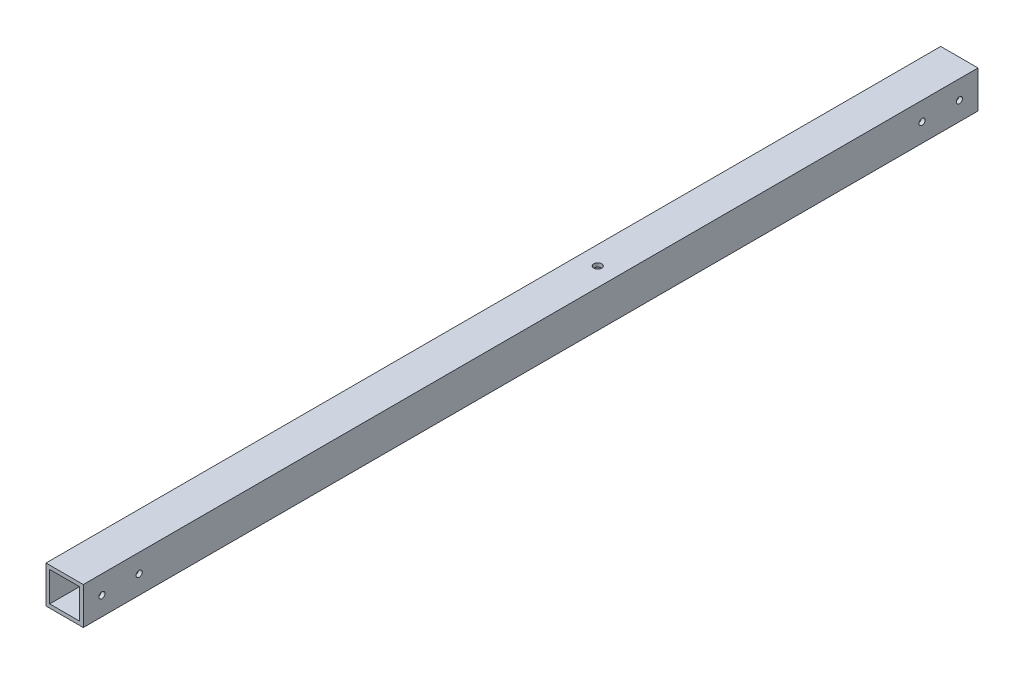
ISO-10303-21;
HEADER;
FILE_DESCRIPTION(('STEP AP214'),'2;1');
FILE_NAME('part.step','',(''),(''),'','','');
FILE_SCHEMA(('AUTOMOTIVE_DESIGN { 1 0 10303 214 1 1 1 1 }'));
ENDSEC;
DATA;
#1=APPLICATION_CONTEXT('core data for automotive mechanical design processes');
#2=APPLICATION_PROTOCOL_DEFINITION('international standard','automotive_design',2000,#1);
#3=PRODUCT_CONTEXT('',#1,'mechanical');
#4=PRODUCT('Part','Part','',(#3));
#5=PRODUCT_RELATED_PRODUCT_CATEGORY('part','',(#4));
#6=PRODUCT_DEFINITION_FORMATION('','',#4);
#7=PRODUCT_DEFINITION_CONTEXT('part definition',#1,'design');
#8=PRODUCT_DEFINITION('design','',#6,#7);
#9=PRODUCT_DEFINITION_SHAPE('','',#8);
#10=(LENGTH_UNIT() NAMED_UNIT(*) SI_UNIT(.MILLI.,.METRE.));
#11=(NAMED_UNIT(*) PLANE_ANGLE_UNIT() SI_UNIT($,.RADIAN.));
#12=(NAMED_UNIT(*) SI_UNIT($,.STERADIAN.) SOLID_ANGLE_UNIT());
#13=UNCERTAINTY_MEASURE_WITH_UNIT(LENGTH_MEASURE(1.E-05),#10,'distance_accuracy_value','');
#14=(GEOMETRIC_REPRESENTATION_CONTEXT(3) GLOBAL_UNCERTAINTY_ASSIGNED_CONTEXT((#13)) GLOBAL_UNIT_ASSIGNED_CONTEXT((#10,
#11,#12)) REPRESENTATION_CONTEXT('',''));
#15=CARTESIAN_POINT('',(0.,0.,0.));
#16=DIRECTION('',(0.,0.,1.));
#17=DIRECTION('',(1.,0.,0.));
#18=AXIS2_PLACEMENT_3D('',#15,#16,#17);
#19=CARTESIAN_POINT('',(10.,10.,560.));
#20=DIRECTION('',(-1.,0.,0.));
#21=DIRECTION('',(0.,0.,1.));
#22=AXIS2_PLACEMENT_3D('',#19,#20,#21);
#23=PLANE('',#22);
#24=CARTESIAN_POINT('',(10.,0.,50.));
#25=DIRECTION('',(1.,0.,0.));
#26=DIRECTION('',(0.,0.,-1.));
#27=AXIS2_PLACEMENT_3D('',#24,#25,#26);
#28=CIRCLE('',#27,1.64999999999999);
#29=CARTESIAN_POINT('',(10.,0.,48.35));
#30=VERTEX_POINT('',#29);
#31=EDGE_CURVE('E178',#30,#30,#28,.T.);
#32=ORIENTED_EDGE('',*,*,#31,.F.);
#33=EDGE_LOOP('',(#32));
#34=FACE_BOUND('',#33,.T.);
#35=CARTESIAN_POINT('',(10.,0.,70.));
#36=DIRECTION('',(1.,0.,0.));
#37=DIRECTION('',(0.,0.,-1.));
#38=AXIS2_PLACEMENT_3D('',#35,#36,#37);
#39=CIRCLE('',#38,1.64999999999999);
#40=CARTESIAN_POINT('',(10.,0.,68.3500000000001));
#41=VERTEX_POINT('',#40);
#42=EDGE_CURVE('E167',#41,#41,#39,.T.);
#43=ORIENTED_EDGE('',*,*,#42,.F.);
#44=EDGE_LOOP('',(#43));
#45=FACE_BOUND('',#44,.T.);
#46=CARTESIAN_POINT('',(10.,0.,490.));
#47=DIRECTION('',(1.,0.,0.));
#48=DIRECTION('',(0.,0.,-1.));
#49=AXIS2_PLACEMENT_3D('',#46,#47,#48);
#50=CIRCLE('',#49,1.64999999999999);
#51=CARTESIAN_POINT('',(10.,0.,488.35));
#52=VERTEX_POINT('',#51);
#53=EDGE_CURVE('E166',#52,#52,#50,.T.);
#54=ORIENTED_EDGE('',*,*,#53,.F.);
#55=EDGE_LOOP('',(#54));
#56=FACE_BOUND('',#55,.T.);
#57=DIRECTION('',(0.,1.,0.));
#58=VECTOR('',#57,1.);
#59=CARTESIAN_POINT('',(10.,10.,520.));
#60=LINE('',#59,#58);
#61=CARTESIAN_POINT('',(10.,-10.,520.));
#62=VERTEX_POINT('',#61);
#63=CARTESIAN_POINT('',(10.,10.,520.));
#64=VERTEX_POINT('',#63);
#65=EDGE_CURVE('E198',#62,#64,#60,.T.);
#66=ORIENTED_EDGE('',*,*,#65,.F.);
#67=DIRECTION('',(0.,0.,-1.));
#68=VECTOR('',#67,1.);
#69=CARTESIAN_POINT('',(10.,-10.,560.));
#70=LINE('',#69,#68);
#71=CARTESIAN_POINT('',(10.,-10.,40.));
#72=VERTEX_POINT('',#71);
#73=EDGE_CURVE('E147',#62,#72,#70,.T.);
#74=ORIENTED_EDGE('',*,*,#73,.T.);
#75=DIRECTION('',(0.,1.,0.));
#76=VECTOR('',#75,1.);
#77=CARTESIAN_POINT('',(10.,10.,40.));
#78=LINE('',#77,#76);
#79=CARTESIAN_POINT('',(10.,10.,40.));
#80=VERTEX_POINT('',#79);
#81=EDGE_CURVE('E142',#72,#80,#78,.T.);
#82=ORIENTED_EDGE('',*,*,#81,.T.);
#83=DIRECTION('',(0.,0.,-1.));
#84=VECTOR('',#83,1.);
#85=CARTESIAN_POINT('',(10.,10.,560.));
#86=LINE('',#85,#84);
#87=EDGE_CURVE('E153',#64,#80,#86,.T.);
#88=ORIENTED_EDGE('',*,*,#87,.F.);
#89=EDGE_LOOP('',(#66,#74,#82,#88));
#90=FACE_BOUND('',#89,.T.);
#91=CARTESIAN_POINT('',(10.,0.,510.));
#92=DIRECTION('',(1.,0.,0.));
#93=DIRECTION('',(0.,0.,-1.));
#94=AXIS2_PLACEMENT_3D('',#91,#92,#93);
#95=CIRCLE('',#94,1.64999999999999);
#96=CARTESIAN_POINT('',(10.,0.,508.35));
#97=VERTEX_POINT('',#96);
#98=EDGE_CURVE('E163',#97,#97,#95,.T.);
#99=ORIENTED_EDGE('',*,*,#98,.F.);
#100=EDGE_LOOP('',(#99));
#101=FACE_BOUND('',#100,.T.);
#102=ADVANCED_FACE('F56',(#34,#45,#56,#90,#101),#23,.F.);
#103=CARTESIAN_POINT('',(-10.,10.,560.));
#104=DIRECTION('',(0.,-1.,0.));
#105=DIRECTION('',(1.,0.,0.));
#106=AXIS2_PLACEMENT_3D('',#103,#104,#105);
#107=PLANE('',#106);
#108=CARTESIAN_POINT('',(0.,10.,234.));
#109=DIRECTION('',(0.,-1.,0.));
#110=DIRECTION('',(0.,0.,-1.));
#111=AXIS2_PLACEMENT_3D('',#108,#109,#110);
#112=CIRCLE('',#111,2.1);
#113=CARTESIAN_POINT('',(0.,10.,231.9));
#114=VERTEX_POINT('',#113);
#115=EDGE_CURVE('E159',#114,#114,#112,.T.);
#116=ORIENTED_EDGE('',*,*,#115,.T.);
#117=EDGE_LOOP('',(#116));
#118=FACE_BOUND('',#117,.T.);
#119=DIRECTION('',(-1.,0.,0.));
#120=VECTOR('',#119,1.);
#121=CARTESIAN_POINT('',(-10.,10.,520.));
#122=LINE('',#121,#120);
#123=CARTESIAN_POINT('',(-10.,10.,520.));
#124=VERTEX_POINT('',#123);
#125=EDGE_CURVE('E196',#64,#124,#122,.T.);
#126=ORIENTED_EDGE('',*,*,#125,.F.);
#127=ORIENTED_EDGE('',*,*,#87,.T.);
#128=DIRECTION('',(-1.,0.,0.));
#129=VECTOR('',#128,1.);
#130=CARTESIAN_POINT('',(-10.,10.,40.));
#131=LINE('',#130,#129);
#132=CARTESIAN_POINT('',(-10.,10.,40.));
#133=VERTEX_POINT('',#132);
#134=EDGE_CURVE('E214',#80,#133,#131,.T.);
#135=ORIENTED_EDGE('',*,*,#134,.T.);
#136=DIRECTION('',(0.,0.,-1.));
#137=VECTOR('',#136,1.);
#138=CARTESIAN_POINT('',(-10.,10.,560.));
#139=LINE('',#138,#137);
#140=EDGE_CURVE('E151',#124,#133,#139,.T.);
#141=ORIENTED_EDGE('',*,*,#140,.F.);
#142=EDGE_LOOP('',(#126,#127,#135,#141));
#143=FACE_BOUND('',#142,.T.);
#144=ADVANCED_FACE('F236',(#118,#143),#107,.F.);
#145=CARTESIAN_POINT('',(-10.,10.,560.));
#146=DIRECTION('',(1.,0.,0.));
#147=DIRECTION('',(0.,1.,0.));
#148=AXIS2_PLACEMENT_3D('',#145,#146,#147);
#149=PLANE('',#148);
#150=DIRECTION('',(0.,-1.,0.));
#151=VECTOR('',#150,1.);
#152=CARTESIAN_POINT('',(-10.,10.,520.));
#153=LINE('',#152,#151);
#154=CARTESIAN_POINT('',(-10.,-10.,520.));
#155=VERTEX_POINT('',#154);
#156=EDGE_CURVE('E72',#124,#155,#153,.T.);
#157=ORIENTED_EDGE('',*,*,#156,.F.);
#158=ORIENTED_EDGE('',*,*,#140,.T.);
#159=DIRECTION('',(0.,-1.,0.));
#160=VECTOR('',#159,1.);
#161=CARTESIAN_POINT('',(-10.,10.,40.));
#162=LINE('',#161,#160);
#163=CARTESIAN_POINT('',(-10.,-10.,40.));
#164=VERTEX_POINT('',#163);
#165=EDGE_CURVE('E211',#133,#164,#162,.T.);
#166=ORIENTED_EDGE('',*,*,#165,.T.);
#167=DIRECTION('',(0.,0.,-1.));
#168=VECTOR('',#167,1.);
#169=CARTESIAN_POINT('',(-10.,-10.,560.));
#170=LINE('',#169,#168);
#171=EDGE_CURVE('E149',#155,#164,#170,.T.);
#172=ORIENTED_EDGE('',*,*,#171,.F.);
#173=EDGE_LOOP('',(#157,#158,#166,#172));
#174=FACE_BOUND('',#173,.T.);
#175=ADVANCED_FACE('F232',(#174),#149,.F.);
#176=CARTESIAN_POINT('',(-10.,-10.,560.));
#177=DIRECTION('',(0.,1.,0.));
#178=DIRECTION('',(0.,0.,1.));
#179=AXIS2_PLACEMENT_3D('',#176,#177,#178);
#180=PLANE('',#179);
#181=CARTESIAN_POINT('',(0.,-10.,234.));
#182=DIRECTION('',(0.,-1.,0.));
#183=DIRECTION('',(0.,0.,-1.));
#184=AXIS2_PLACEMENT_3D('',#181,#182,#183);
#185=CIRCLE('',#184,6.);
#186=CARTESIAN_POINT('',(0.,-10.,228.));
#187=VERTEX_POINT('',#186);
#188=EDGE_CURVE('E160',#187,#187,#185,.T.);
#189=ORIENTED_EDGE('',*,*,#188,.F.);
#190=EDGE_LOOP('',(#189));
#191=FACE_BOUND('',#190,.T.);
#192=DIRECTION('',(1.,0.,0.));
#193=VECTOR('',#192,1.);
#194=CARTESIAN_POINT('',(-10.,-10.,520.));
#195=LINE('',#194,#193);
#196=EDGE_CURVE('E193',#155,#62,#195,.T.);
#197=ORIENTED_EDGE('',*,*,#196,.F.);
#198=ORIENTED_EDGE('',*,*,#171,.T.);
#199=DIRECTION('',(1.,0.,0.));
#200=VECTOR('',#199,1.);
#201=CARTESIAN_POINT('',(-10.,-10.,40.));
#202=LINE('',#201,#200);
#203=EDGE_CURVE('E208',#164,#72,#202,.T.);
#204=ORIENTED_EDGE('',*,*,#203,.T.);
#205=ORIENTED_EDGE('',*,*,#73,.F.);
#206=EDGE_LOOP('',(#197,#198,#204,#205));
#207=FACE_BOUND('',#206,.T.);
#208=ADVANCED_FACE('F229',(#191,#207),#180,.F.);
#209=CARTESIAN_POINT('',(8.,8.,560.));
#210=DIRECTION('',(-1.,0.,0.));
#211=DIRECTION('',(0.,0.,1.));
#212=AXIS2_PLACEMENT_3D('',#209,#210,#211);
#213=PLANE('',#212);
#214=CARTESIAN_POINT('',(8.,0.,50.));
#215=DIRECTION('',(-1.,0.,0.));
#216=DIRECTION('',(0.,0.,1.));
#217=AXIS2_PLACEMENT_3D('',#214,#215,#216);
#218=CIRCLE('',#217,1.64999999999999);
#219=CARTESIAN_POINT('',(8.,0.,51.65));
#220=VERTEX_POINT('',#219);
#221=EDGE_CURVE('E59',#220,#220,#218,.T.);
#222=ORIENTED_EDGE('',*,*,#221,.F.);
#223=EDGE_LOOP('',(#222));
#224=FACE_BOUND('',#223,.T.);
#225=CARTESIAN_POINT('',(8.,0.,70.));
#226=DIRECTION('',(-1.,0.,0.));
#227=DIRECTION('',(0.,0.,1.));
#228=AXIS2_PLACEMENT_3D('',#225,#226,#227);
#229=CIRCLE('',#228,1.64999999999999);
#230=CARTESIAN_POINT('',(8.,0.,71.65));
#231=VERTEX_POINT('',#230);
#232=EDGE_CURVE('E164',#231,#231,#229,.T.);
#233=ORIENTED_EDGE('',*,*,#232,.F.);
#234=EDGE_LOOP('',(#233));
#235=FACE_BOUND('',#234,.T.);
#236=CARTESIAN_POINT('',(8.,0.,490.));
#237=DIRECTION('',(-1.,0.,0.));
#238=DIRECTION('',(0.,0.,1.));
#239=AXIS2_PLACEMENT_3D('',#236,#237,#238);
#240=CIRCLE('',#239,1.64999999999999);
#241=CARTESIAN_POINT('',(8.,0.,491.65));
#242=VERTEX_POINT('',#241);
#243=EDGE_CURVE('E171',#242,#242,#240,.T.);
#244=ORIENTED_EDGE('',*,*,#243,.F.);
#245=EDGE_LOOP('',(#244));
#246=FACE_BOUND('',#245,.T.);
#247=CARTESIAN_POINT('',(8.,0.,510.));
#248=DIRECTION('',(-1.,0.,0.));
#249=DIRECTION('',(0.,0.,1.));
#250=AXIS2_PLACEMENT_3D('',#247,#248,#249);
#251=CIRCLE('',#250,1.64999999999999);
#252=CARTESIAN_POINT('',(8.,0.,511.65));
#253=VERTEX_POINT('',#252);
#254=EDGE_CURVE('E161',#253,#253,#251,.T.);
#255=ORIENTED_EDGE('',*,*,#254,.F.);
#256=EDGE_LOOP('',(#255));
#257=FACE_BOUND('',#256,.T.);
#258=DIRECTION('',(0.,0.,-1.));
#259=VECTOR('',#258,1.);
#260=CARTESIAN_POINT('',(8.,-8.,560.));
#261=LINE('',#260,#259);
#262=CARTESIAN_POINT('',(8.,-8.,520.));
#263=VERTEX_POINT('',#262);
#264=CARTESIAN_POINT('',(8.,-8.,40.));
#265=VERTEX_POINT('',#264);
#266=EDGE_CURVE('E138',#263,#265,#261,.T.);
#267=ORIENTED_EDGE('',*,*,#266,.F.);
#268=DIRECTION('',(0.,1.,0.));
#269=VECTOR('',#268,1.);
#270=CARTESIAN_POINT('',(8.,8.,520.));
#271=LINE('',#270,#269);
#272=CARTESIAN_POINT('',(8.,8.,520.));
#273=VERTEX_POINT('',#272);
#274=EDGE_CURVE('E80',#263,#273,#271,.T.);
#275=ORIENTED_EDGE('',*,*,#274,.T.);
#276=DIRECTION('',(0.,0.,-1.));
#277=VECTOR('',#276,1.);
#278=CARTESIAN_POINT('',(8.,8.,560.));
#279=LINE('',#278,#277);
#280=CARTESIAN_POINT('',(8.,8.,40.));
#281=VERTEX_POINT('',#280);
#282=EDGE_CURVE('E140',#273,#281,#279,.T.);
#283=ORIENTED_EDGE('',*,*,#282,.T.);
#284=DIRECTION('',(0.,1.,0.));
#285=VECTOR('',#284,1.);
#286=CARTESIAN_POINT('',(8.,8.,40.));
#287=LINE('',#286,#285);
#288=EDGE_CURVE('E205',#265,#281,#287,.T.);
#289=ORIENTED_EDGE('',*,*,#288,.F.);
#290=EDGE_LOOP('',(#267,#275,#283,#289));
#291=FACE_BOUND('',#290,.T.);
#292=ADVANCED_FACE('F286',(#224,#235,#246,#257,#291),#213,.T.);
#293=CARTESIAN_POINT('',(-8.,8.,560.));
#294=DIRECTION('',(0.,-1.,0.));
#295=DIRECTION('',(0.,0.,-1.));
#296=AXIS2_PLACEMENT_3D('',#293,#294,#295);
#297=PLANE('',#296);
#298=CARTESIAN_POINT('',(0.,8.,234.));
#299=DIRECTION('',(0.,-1.,0.));
#300=DIRECTION('',(0.,0.,-1.));
#301=AXIS2_PLACEMENT_3D('',#298,#299,#300);
#302=CIRCLE('',#301,2.1);
#303=CARTESIAN_POINT('',(0.,8.,231.9));
#304=VERTEX_POINT('',#303);
#305=EDGE_CURVE('E133',#304,#304,#302,.T.);
#306=ORIENTED_EDGE('',*,*,#305,.F.);
#307=EDGE_LOOP('',(#306));
#308=FACE_BOUND('',#307,.T.);
#309=ORIENTED_EDGE('',*,*,#282,.F.);
#310=DIRECTION('',(-1.,0.,0.));
#311=VECTOR('',#310,1.);
#312=CARTESIAN_POINT('',(-8.,8.,520.));
#313=LINE('',#312,#311);
#314=CARTESIAN_POINT('',(-8.,8.,520.));
#315=VERTEX_POINT('',#314);
#316=EDGE_CURVE('E132',#273,#315,#313,.T.);
#317=ORIENTED_EDGE('',*,*,#316,.T.);
#318=DIRECTION('',(0.,0.,-1.));
#319=VECTOR('',#318,1.);
#320=CARTESIAN_POINT('',(-8.,8.,560.));
#321=LINE('',#320,#319);
#322=CARTESIAN_POINT('',(-8.,8.,40.));
#323=VERTEX_POINT('',#322);
#324=EDGE_CURVE('E131',#315,#323,#321,.T.);
#325=ORIENTED_EDGE('',*,*,#324,.T.);
#326=DIRECTION('',(-1.,0.,0.));
#327=VECTOR('',#326,1.);
#328=CARTESIAN_POINT('',(-8.,8.,40.));
#329=LINE('',#328,#327);
#330=EDGE_CURVE('E202',#281,#323,#329,.T.);
#331=ORIENTED_EDGE('',*,*,#330,.F.);
#332=EDGE_LOOP('',(#309,#317,#325,#331));
#333=FACE_BOUND('',#332,.T.);
#334=ADVANCED_FACE('F292',(#308,#333),#297,.T.);
#335=CARTESIAN_POINT('',(-8.,8.,560.));
#336=DIRECTION('',(1.,0.,0.));
#337=DIRECTION('',(0.,0.,-1.));
#338=AXIS2_PLACEMENT_3D('',#335,#336,#337);
#339=PLANE('',#338);
#340=ORIENTED_EDGE('',*,*,#324,.F.);
#341=DIRECTION('',(0.,-1.,0.));
#342=VECTOR('',#341,1.);
#343=CARTESIAN_POINT('',(-8.,8.,520.));
#344=LINE('',#343,#342);
#345=CARTESIAN_POINT('',(-8.,-8.,520.));
#346=VERTEX_POINT('',#345);
#347=EDGE_CURVE('E120',#315,#346,#344,.T.);
#348=ORIENTED_EDGE('',*,*,#347,.T.);
#349=DIRECTION('',(0.,0.,-1.));
#350=VECTOR('',#349,1.);
#351=CARTESIAN_POINT('',(-8.,-8.,560.));
#352=LINE('',#351,#350);
#353=CARTESIAN_POINT('',(-8.,-8.,40.));
#354=VERTEX_POINT('',#353);
#355=EDGE_CURVE('E129',#346,#354,#352,.T.);
#356=ORIENTED_EDGE('',*,*,#355,.T.);
#357=DIRECTION('',(0.,-1.,0.));
#358=VECTOR('',#357,1.);
#359=CARTESIAN_POINT('',(-8.,8.,40.));
#360=LINE('',#359,#358);
#361=EDGE_CURVE('E200',#323,#354,#360,.T.);
#362=ORIENTED_EDGE('',*,*,#361,.F.);
#363=EDGE_LOOP('',(#340,#348,#356,#362));
#364=FACE_BOUND('',#363,.T.);
#365=ADVANCED_FACE('F127',(#364),#339,.T.);
#366=CARTESIAN_POINT('',(-8.,-8.,560.));
#367=DIRECTION('',(0.,1.,0.));
#368=DIRECTION('',(0.,0.,1.));
#369=AXIS2_PLACEMENT_3D('',#366,#367,#368);
#370=PLANE('',#369);
#371=CARTESIAN_POINT('',(0.,-8.,234.));
#372=DIRECTION('',(0.,1.,0.));
#373=DIRECTION('',(0.,0.,1.));
#374=AXIS2_PLACEMENT_3D('',#371,#372,#373);
#375=CIRCLE('',#374,6.);
#376=CARTESIAN_POINT('',(0.,-8.,240.));
#377=VERTEX_POINT('',#376);
#378=EDGE_CURVE('E156',#377,#377,#375,.T.);
#379=ORIENTED_EDGE('',*,*,#378,.F.);
#380=EDGE_LOOP('',(#379));
#381=FACE_BOUND('',#380,.T.);
#382=ORIENTED_EDGE('',*,*,#355,.F.);
#383=DIRECTION('',(1.,0.,0.));
#384=VECTOR('',#383,1.);
#385=CARTESIAN_POINT('',(-8.,-8.,520.));
#386=LINE('',#385,#384);
#387=EDGE_CURVE('E14',#346,#263,#386,.T.);
#388=ORIENTED_EDGE('',*,*,#387,.T.);
#389=ORIENTED_EDGE('',*,*,#266,.T.);
#390=DIRECTION('',(1.,0.,0.));
#391=VECTOR('',#390,1.);
#392=CARTESIAN_POINT('',(-8.,-8.,40.));
#393=LINE('',#392,#391);
#394=EDGE_CURVE('E64',#354,#265,#393,.T.);
#395=ORIENTED_EDGE('',*,*,#394,.F.);
#396=EDGE_LOOP('',(#382,#388,#389,#395));
#397=FACE_BOUND('',#396,.T.);
#398=ADVANCED_FACE('F136',(#381,#397),#370,.T.);
#399=CARTESIAN_POINT('',(0.,0.,40.));
#400=DIRECTION('',(0.,0.,1.));
#401=DIRECTION('',(1.,0.,0.));
#402=AXIS2_PLACEMENT_3D('',#399,#400,#401);
#403=PLANE('',#402);
#404=ORIENTED_EDGE('',*,*,#288,.T.);
#405=ORIENTED_EDGE('',*,*,#330,.T.);
#406=ORIENTED_EDGE('',*,*,#361,.T.);
#407=ORIENTED_EDGE('',*,*,#394,.T.);
#408=EDGE_LOOP('',(#404,#405,#406,#407));
#409=FACE_BOUND('',#408,.T.);
#410=ORIENTED_EDGE('',*,*,#203,.F.);
#411=ORIENTED_EDGE('',*,*,#165,.F.);
#412=ORIENTED_EDGE('',*,*,#134,.F.);
#413=ORIENTED_EDGE('',*,*,#81,.F.);
#414=EDGE_LOOP('',(#410,#411,#412,#413));
#415=FACE_BOUND('',#414,.T.);
#416=ADVANCED_FACE('F226',(#409,#415),#403,.F.);
#417=CARTESIAN_POINT('',(0.,0.,520.));
#418=DIRECTION('',(0.,0.,1.));
#419=DIRECTION('',(1.,0.,0.));
#420=AXIS2_PLACEMENT_3D('',#417,#418,#419);
#421=PLANE('',#420);
#422=ORIENTED_EDGE('',*,*,#387,.F.);
#423=ORIENTED_EDGE('',*,*,#347,.F.);
#424=ORIENTED_EDGE('',*,*,#316,.F.);
#425=ORIENTED_EDGE('',*,*,#274,.F.);
#426=EDGE_LOOP('',(#422,#423,#424,#425));
#427=FACE_BOUND('',#426,.T.);
#428=ORIENTED_EDGE('',*,*,#65,.T.);
#429=ORIENTED_EDGE('',*,*,#125,.T.);
#430=ORIENTED_EDGE('',*,*,#156,.T.);
#431=ORIENTED_EDGE('',*,*,#196,.T.);
#432=EDGE_LOOP('',(#428,#429,#430,#431));
#433=FACE_BOUND('',#432,.T.);
#434=ADVANCED_FACE('F119',(#427,#433),#421,.T.);
#435=CARTESIAN_POINT('',(0.,10.,234.));
#436=DIRECTION('',(0.,-1.,0.));
#437=DIRECTION('',(0.,0.,-1.));
#438=AXIS2_PLACEMENT_3D('',#435,#436,#437);
#439=CYLINDRICAL_SURFACE('',#438,2.1);
#440=ORIENTED_EDGE('',*,*,#305,.T.);
#441=EDGE_LOOP('',(#440));
#442=FACE_BOUND('',#441,.T.);
#443=ORIENTED_EDGE('',*,*,#115,.F.);
#444=EDGE_LOOP('',(#443));
#445=FACE_BOUND('',#444,.T.);
#446=ADVANCED_FACE('F238',(#442,#445),#439,.F.);
#447=CARTESIAN_POINT('',(0.,0.,234.));
#448=DIRECTION('',(0.,-1.,0.));
#449=DIRECTION('',(0.,0.,-1.));
#450=AXIS2_PLACEMENT_3D('',#447,#448,#449);
#451=CYLINDRICAL_SURFACE('',#450,6.);
#452=ORIENTED_EDGE('',*,*,#378,.T.);
#453=EDGE_LOOP('',(#452));
#454=FACE_BOUND('',#453,.T.);
#455=ORIENTED_EDGE('',*,*,#188,.T.);
#456=EDGE_LOOP('',(#455));
#457=FACE_BOUND('',#456,.T.);
#458=ADVANCED_FACE('F244',(#454,#457),#451,.F.);
#459=CARTESIAN_POINT('',(10.,0.,510.));
#460=DIRECTION('',(1.,0.,0.));
#461=DIRECTION('',(0.,0.,-1.));
#462=AXIS2_PLACEMENT_3D('',#459,#460,#461);
#463=CYLINDRICAL_SURFACE('',#462,1.64999999999999);
#464=ORIENTED_EDGE('',*,*,#254,.T.);
#465=EDGE_LOOP('',(#464));
#466=FACE_BOUND('',#465,.T.);
#467=ORIENTED_EDGE('',*,*,#98,.T.);
#468=EDGE_LOOP('',(#467));
#469=FACE_BOUND('',#468,.T.);
#470=ADVANCED_FACE('F264',(#466,#469),#463,.F.);
#471=CARTESIAN_POINT('',(10.,0.,490.));
#472=DIRECTION('',(1.,0.,0.));
#473=DIRECTION('',(0.,0.,-1.));
#474=AXIS2_PLACEMENT_3D('',#471,#472,#473);
#475=CYLINDRICAL_SURFACE('',#474,1.64999999999999);
#476=ORIENTED_EDGE('',*,*,#243,.T.);
#477=EDGE_LOOP('',(#476));
#478=FACE_BOUND('',#477,.T.);
#479=ORIENTED_EDGE('',*,*,#53,.T.);
#480=EDGE_LOOP('',(#479));
#481=FACE_BOUND('',#480,.T.);
#482=ADVANCED_FACE('F261',(#478,#481),#475,.F.);
#483=CARTESIAN_POINT('',(10.,0.,70.));
#484=DIRECTION('',(1.,0.,0.));
#485=DIRECTION('',(0.,0.,-1.));
#486=AXIS2_PLACEMENT_3D('',#483,#484,#485);
#487=CYLINDRICAL_SURFACE('',#486,1.64999999999999);
#488=ORIENTED_EDGE('',*,*,#232,.T.);
#489=EDGE_LOOP('',(#488));
#490=FACE_BOUND('',#489,.T.);
#491=ORIENTED_EDGE('',*,*,#42,.T.);
#492=EDGE_LOOP('',(#491));
#493=FACE_BOUND('',#492,.T.);
#494=ADVANCED_FACE('F263',(#490,#493),#487,.F.);
#495=CARTESIAN_POINT('',(10.,0.,50.));
#496=DIRECTION('',(1.,0.,0.));
#497=DIRECTION('',(0.,0.,-1.));
#498=AXIS2_PLACEMENT_3D('',#495,#496,#497);
#499=CYLINDRICAL_SURFACE('',#498,1.64999999999999);
#500=ORIENTED_EDGE('',*,*,#221,.T.);
#501=EDGE_LOOP('',(#500));
#502=FACE_BOUND('',#501,.T.);
#503=ORIENTED_EDGE('',*,*,#31,.T.);
#504=EDGE_LOOP('',(#503));
#505=FACE_BOUND('',#504,.T.);
#506=ADVANCED_FACE('F271',(#502,#505),#499,.F.);
#507=CLOSED_SHELL('',(#102,#144,#175,#208,#292,#334,#365,#398,#416,#434,#446,#458,#470,#482,
#494,#506));
#508=MANIFOLD_SOLID_BREP('B2',#507);
#509=ADVANCED_BREP_SHAPE_REPRESENTATION('',(#18,#508),#14);
#510=SHAPE_DEFINITION_REPRESENTATION(#9,#509);
ENDSEC;
END-ISO-10303-21;
